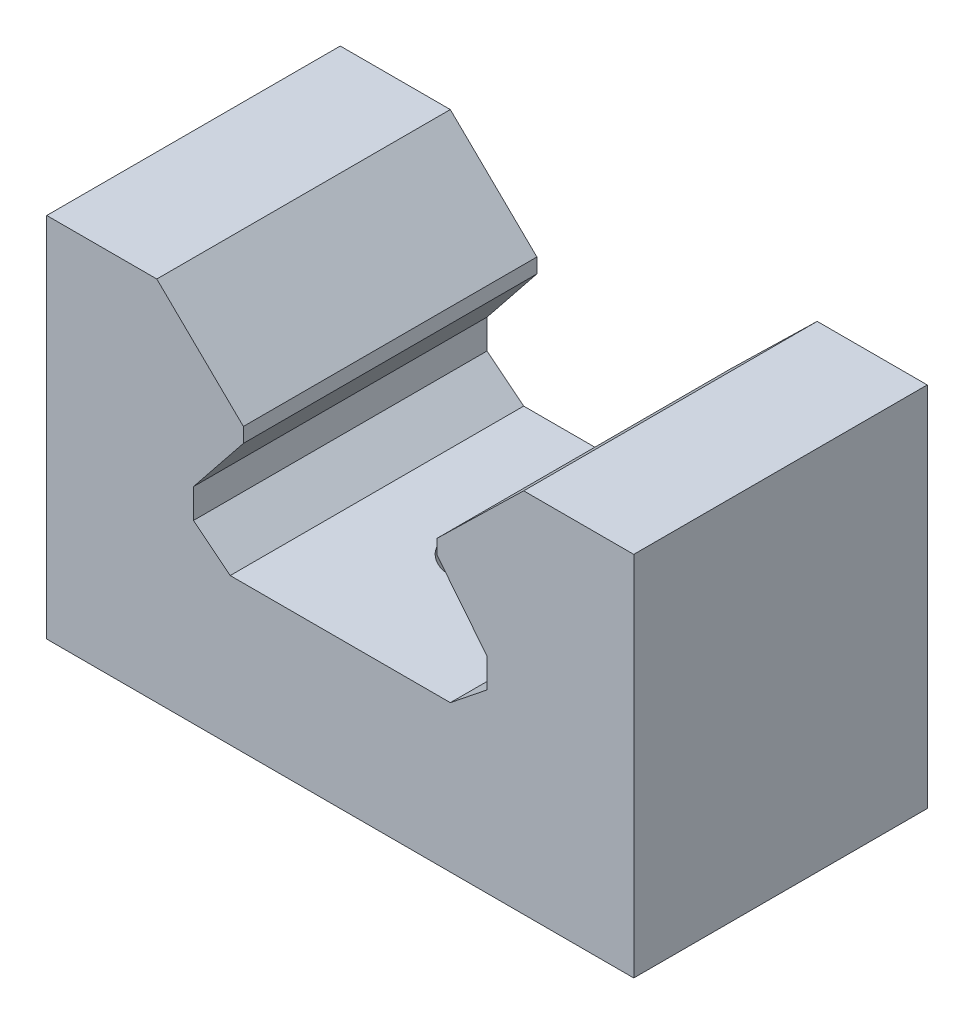
ISO-10303-21;
HEADER;
FILE_DESCRIPTION(('STEP AP214'),'2;1');
FILE_NAME('part.step','',(''),(''),'','','');
FILE_SCHEMA(('AUTOMOTIVE_DESIGN { 1 0 10303 214 1 1 1 1 }'));
ENDSEC;
DATA;
#1=APPLICATION_CONTEXT('core data for automotive mechanical design processes');
#2=APPLICATION_PROTOCOL_DEFINITION('international standard','automotive_design',2000,#1);
#3=PRODUCT_CONTEXT('',#1,'mechanical');
#4=PRODUCT('Part','Part','',(#3));
#5=PRODUCT_RELATED_PRODUCT_CATEGORY('part','',(#4));
#6=PRODUCT_DEFINITION_FORMATION('','',#4);
#7=PRODUCT_DEFINITION_CONTEXT('part definition',#1,'design');
#8=PRODUCT_DEFINITION('design','',#6,#7);
#9=PRODUCT_DEFINITION_SHAPE('','',#8);
#10=(LENGTH_UNIT() NAMED_UNIT(*) SI_UNIT(.MILLI.,.METRE.));
#11=(NAMED_UNIT(*) PLANE_ANGLE_UNIT() SI_UNIT($,.RADIAN.));
#12=(NAMED_UNIT(*) SI_UNIT($,.STERADIAN.) SOLID_ANGLE_UNIT());
#13=UNCERTAINTY_MEASURE_WITH_UNIT(LENGTH_MEASURE(1.E-05),#10,'distance_accuracy_value','');
#14=(GEOMETRIC_REPRESENTATION_CONTEXT(3) GLOBAL_UNCERTAINTY_ASSIGNED_CONTEXT((#13)) GLOBAL_UNIT_ASSIGNED_CONTEXT((#10,
#11,#12)) REPRESENTATION_CONTEXT('',''));
#15=CARTESIAN_POINT('',(0.,0.,0.));
#16=DIRECTION('',(0.,0.,1.));
#17=DIRECTION('',(1.,0.,0.));
#18=AXIS2_PLACEMENT_3D('',#15,#16,#17);
#19=CARTESIAN_POINT('',(-20.,12.5,20.));
#20=DIRECTION('',(0.,-1.,0.));
#21=DIRECTION('',(0.,0.,-1.));
#22=AXIS2_PLACEMENT_3D('',#19,#20,#21);
#23=PLANE('',#22);
#24=DIRECTION('',(0.,0.,1.));
#25=VECTOR('',#24,1.);
#26=CARTESIAN_POINT('',(-12.5,12.5,-64.0434422872475));
#27=LINE('',#26,#25);
#28=CARTESIAN_POINT('',(-12.5,12.5,0.));
#29=VERTEX_POINT('',#28);
#30=CARTESIAN_POINT('',(-12.5,12.5,20.));
#31=VERTEX_POINT('',#30);
#32=EDGE_CURVE('E178',#29,#31,#27,.T.);
#33=ORIENTED_EDGE('',*,*,#32,.F.);
#34=DIRECTION('',(-1.,0.,0.));
#35=VECTOR('',#34,1.);
#36=CARTESIAN_POINT('',(-20.,12.5,0.));
#37=LINE('',#36,#35);
#38=CARTESIAN_POINT('',(-20.,12.5,0.));
#39=VERTEX_POINT('',#38);
#40=EDGE_CURVE('E160',#29,#39,#37,.T.);
#41=ORIENTED_EDGE('',*,*,#40,.T.);
#42=DIRECTION('',(0.,0.,-1.));
#43=VECTOR('',#42,1.);
#44=CARTESIAN_POINT('',(-20.,12.5,20.));
#45=LINE('',#44,#43);
#46=CARTESIAN_POINT('',(-20.,12.5,20.));
#47=VERTEX_POINT('',#46);
#48=EDGE_CURVE('E50',#47,#39,#45,.T.);
#49=ORIENTED_EDGE('',*,*,#48,.F.);
#50=DIRECTION('',(-1.,0.,0.));
#51=VECTOR('',#50,1.);
#52=CARTESIAN_POINT('',(-20.,12.5,20.));
#53=LINE('',#52,#51);
#54=EDGE_CURVE('E213',#31,#47,#53,.T.);
#55=ORIENTED_EDGE('',*,*,#54,.F.);
#56=EDGE_LOOP('',(#33,#41,#49,#55));
#57=FACE_BOUND('',#56,.T.);
#58=ADVANCED_FACE('F42',(#57),#23,.F.);
#59=CARTESIAN_POINT('',(20.,12.5,20.));
#60=DIRECTION('',(-1.,0.,0.));
#61=DIRECTION('',(0.,0.,1.));
#62=AXIS2_PLACEMENT_3D('',#59,#60,#61);
#63=PLANE('',#62);
#64=DIRECTION('',(0.,1.,0.));
#65=VECTOR('',#64,1.);
#66=CARTESIAN_POINT('',(20.,12.5,0.));
#67=LINE('',#66,#65);
#68=CARTESIAN_POINT('',(20.,-12.5,0.));
#69=VERTEX_POINT('',#68);
#70=CARTESIAN_POINT('',(20.,12.5,0.));
#71=VERTEX_POINT('',#70);
#72=EDGE_CURVE('E209',#69,#71,#67,.T.);
#73=ORIENTED_EDGE('',*,*,#72,.T.);
#74=DIRECTION('',(0.,0.,-1.));
#75=VECTOR('',#74,1.);
#76=CARTESIAN_POINT('',(20.,12.5,20.));
#77=LINE('',#76,#75);
#78=CARTESIAN_POINT('',(20.,12.5,20.));
#79=VERTEX_POINT('',#78);
#80=EDGE_CURVE('E11',#79,#71,#77,.T.);
#81=ORIENTED_EDGE('',*,*,#80,.F.);
#82=DIRECTION('',(0.,1.,0.));
#83=VECTOR('',#82,1.);
#84=CARTESIAN_POINT('',(20.,12.5,20.));
#85=LINE('',#84,#83);
#86=CARTESIAN_POINT('',(20.,-12.5,20.));
#87=VERTEX_POINT('',#86);
#88=EDGE_CURVE('E210',#87,#79,#85,.T.);
#89=ORIENTED_EDGE('',*,*,#88,.F.);
#90=DIRECTION('',(0.,0.,-1.));
#91=VECTOR('',#90,1.);
#92=CARTESIAN_POINT('',(20.,-12.5,20.));
#93=LINE('',#92,#91);
#94=EDGE_CURVE('E221',#87,#69,#93,.T.);
#95=ORIENTED_EDGE('',*,*,#94,.T.);
#96=EDGE_LOOP('',(#73,#81,#89,#95));
#97=FACE_BOUND('',#96,.T.);
#98=ADVANCED_FACE('F44',(#97),#63,.F.);
#99=CARTESIAN_POINT('',(12.5,12.5,0.));
#100=VERTEX_POINT('',#99);
#101=EDGE_CURVE('E224',#71,#100,#37,.T.);
#102=ORIENTED_EDGE('',*,*,#101,.T.);
#103=DIRECTION('',(0.,0.,1.));
#104=VECTOR('',#103,1.);
#105=CARTESIAN_POINT('',(12.5,12.5,-64.0434422872475));
#106=LINE('',#105,#104);
#107=CARTESIAN_POINT('',(12.5,12.5,20.));
#108=VERTEX_POINT('',#107);
#109=EDGE_CURVE('E207',#100,#108,#106,.T.);
#110=ORIENTED_EDGE('',*,*,#109,.T.);
#111=EDGE_CURVE('E215',#79,#108,#53,.T.);
#112=ORIENTED_EDGE('',*,*,#111,.F.);
#113=ORIENTED_EDGE('',*,*,#80,.T.);
#114=EDGE_LOOP('',(#102,#110,#112,#113));
#115=FACE_BOUND('',#114,.T.);
#116=ADVANCED_FACE('F253',(#115),#23,.F.);
#117=CARTESIAN_POINT('',(-20.,12.5,20.));
#118=DIRECTION('',(1.,0.,0.));
#119=DIRECTION('',(0.,0.,-1.));
#120=AXIS2_PLACEMENT_3D('',#117,#118,#119);
#121=PLANE('',#120);
#122=DIRECTION('',(0.,-1.,0.));
#123=VECTOR('',#122,1.);
#124=CARTESIAN_POINT('',(-20.,12.5,0.));
#125=LINE('',#124,#123);
#126=CARTESIAN_POINT('',(-20.,-12.5,0.));
#127=VERTEX_POINT('',#126);
#128=EDGE_CURVE('E227',#39,#127,#125,.T.);
#129=ORIENTED_EDGE('',*,*,#128,.T.);
#130=DIRECTION('',(0.,0.,-1.));
#131=VECTOR('',#130,1.);
#132=CARTESIAN_POINT('',(-20.,-12.5,20.));
#133=LINE('',#132,#131);
#134=CARTESIAN_POINT('',(-20.,-12.5,20.));
#135=VERTEX_POINT('',#134);
#136=EDGE_CURVE('E232',#135,#127,#133,.T.);
#137=ORIENTED_EDGE('',*,*,#136,.F.);
#138=DIRECTION('',(0.,-1.,0.));
#139=VECTOR('',#138,1.);
#140=CARTESIAN_POINT('',(-20.,12.5,20.));
#141=LINE('',#140,#139);
#142=EDGE_CURVE('E217',#47,#135,#141,.T.);
#143=ORIENTED_EDGE('',*,*,#142,.F.);
#144=ORIENTED_EDGE('',*,*,#48,.T.);
#145=EDGE_LOOP('',(#129,#137,#143,#144));
#146=FACE_BOUND('',#145,.T.);
#147=ADVANCED_FACE('F238',(#146),#121,.F.);
#148=CARTESIAN_POINT('',(-20.,-12.5,20.));
#149=DIRECTION('',(0.,1.,0.));
#150=DIRECTION('',(0.,0.,1.));
#151=AXIS2_PLACEMENT_3D('',#148,#149,#150);
#152=PLANE('',#151);
#153=CARTESIAN_POINT('',(0.,-12.5,10.));
#154=DIRECTION('',(0.,-1.,0.));
#155=DIRECTION('',(0.,0.,-1.));
#156=AXIS2_PLACEMENT_3D('',#153,#154,#155);
#157=CIRCLE('',#156,2.5);
#158=CARTESIAN_POINT('',(0.,-12.5,7.5));
#159=VERTEX_POINT('',#158);
#160=EDGE_CURVE('E363',#159,#159,#157,.T.);
#161=ORIENTED_EDGE('',*,*,#160,.F.);
#162=EDGE_LOOP('',(#161));
#163=FACE_BOUND('',#162,.T.);
#164=DIRECTION('',(1.,0.,0.));
#165=VECTOR('',#164,1.);
#166=CARTESIAN_POINT('',(-20.,-12.5,0.));
#167=LINE('',#166,#165);
#168=EDGE_CURVE('E214',#127,#69,#167,.T.);
#169=ORIENTED_EDGE('',*,*,#168,.T.);
#170=ORIENTED_EDGE('',*,*,#94,.F.);
#171=DIRECTION('',(1.,0.,0.));
#172=VECTOR('',#171,1.);
#173=CARTESIAN_POINT('',(-20.,-12.5,20.));
#174=LINE('',#173,#172);
#175=EDGE_CURVE('E219',#135,#87,#174,.T.);
#176=ORIENTED_EDGE('',*,*,#175,.F.);
#177=ORIENTED_EDGE('',*,*,#136,.T.);
#178=EDGE_LOOP('',(#169,#170,#176,#177));
#179=FACE_BOUND('',#178,.T.);
#180=ADVANCED_FACE('F246',(#163,#179),#152,.F.);
#181=CARTESIAN_POINT('',(0.,0.,20.));
#182=DIRECTION('',(0.,0.,1.));
#183=DIRECTION('',(1.,0.,0.));
#184=AXIS2_PLACEMENT_3D('',#181,#182,#183);
#185=PLANE('',#184);
#186=DIRECTION('',(0.716151801181329,0.697944551998752,0.));
#187=VECTOR('',#186,1.);
#188=CARTESIAN_POINT('',(6.6,6.75000000000001,20.));
#189=LINE('',#188,#187);
#190=CARTESIAN_POINT('',(6.6,6.75000000000001,20.));
#191=VERTEX_POINT('',#190);
#192=EDGE_CURVE('E57',#191,#108,#189,.T.);
#193=ORIENTED_EDGE('',*,*,#192,.F.);
#194=DIRECTION('',(0.,1.,0.));
#195=VECTOR('',#194,1.);
#196=CARTESIAN_POINT('',(6.6,5.75000000000001,20.));
#197=LINE('',#196,#195);
#198=CARTESIAN_POINT('',(6.6,5.75000000000001,20.));
#199=VERTEX_POINT('',#198);
#200=EDGE_CURVE('E61',#199,#191,#197,.T.);
#201=ORIENTED_EDGE('',*,*,#200,.F.);
#202=DIRECTION('',(-0.624695047554424,0.780868809443031,0.));
#203=VECTOR('',#202,1.);
#204=CARTESIAN_POINT('',(10.,1.5,20.));
#205=LINE('',#204,#203);
#206=CARTESIAN_POINT('',(10.,1.5,20.));
#207=VERTEX_POINT('',#206);
#208=EDGE_CURVE('E270',#207,#199,#205,.T.);
#209=ORIENTED_EDGE('',*,*,#208,.F.);
#210=DIRECTION('',(0.,1.,0.));
#211=VECTOR('',#210,1.);
#212=CARTESIAN_POINT('',(10.,-0.499999999999995,20.));
#213=LINE('',#212,#211);
#214=CARTESIAN_POINT('',(10.,-0.499999999999996,20.));
#215=VERTEX_POINT('',#214);
#216=EDGE_CURVE('E294',#215,#207,#213,.T.);
#217=ORIENTED_EDGE('',*,*,#216,.F.);
#218=DIRECTION('',(0.78086880944303,0.624695047554424,0.));
#219=VECTOR('',#218,1.);
#220=CARTESIAN_POINT('',(7.5,-2.5,20.));
#221=LINE('',#220,#219);
#222=CARTESIAN_POINT('',(7.5,-2.5,20.));
#223=VERTEX_POINT('',#222);
#224=EDGE_CURVE('E291',#223,#215,#221,.T.);
#225=ORIENTED_EDGE('',*,*,#224,.F.);
#226=DIRECTION('',(1.,0.,0.));
#227=VECTOR('',#226,1.);
#228=CARTESIAN_POINT('',(7.5,-2.5,20.));
#229=LINE('',#228,#227);
#230=CARTESIAN_POINT('',(-7.5,-2.49999999999999,20.));
#231=VERTEX_POINT('',#230);
#232=EDGE_CURVE('E288',#231,#223,#229,.T.);
#233=ORIENTED_EDGE('',*,*,#232,.F.);
#234=DIRECTION('',(0.780868809443031,-0.624695047554424,0.));
#235=VECTOR('',#234,1.);
#236=CARTESIAN_POINT('',(-7.5,-2.49999999999999,20.));
#237=LINE('',#236,#235);
#238=CARTESIAN_POINT('',(-10.,-0.499999999999995,20.));
#239=VERTEX_POINT('',#238);
#240=EDGE_CURVE('E285',#239,#231,#237,.T.);
#241=ORIENTED_EDGE('',*,*,#240,.F.);
#242=DIRECTION('',(0.,-1.,0.));
#243=VECTOR('',#242,1.);
#244=CARTESIAN_POINT('',(-10.,-0.499999999999995,20.));
#245=LINE('',#244,#243);
#246=CARTESIAN_POINT('',(-10.,1.5,20.));
#247=VERTEX_POINT('',#246);
#248=EDGE_CURVE('E282',#247,#239,#245,.T.);
#249=ORIENTED_EDGE('',*,*,#248,.F.);
#250=DIRECTION('',(-0.624695047554424,-0.780868809443031,0.));
#251=VECTOR('',#250,1.);
#252=CARTESIAN_POINT('',(-10.,1.5,20.));
#253=LINE('',#252,#251);
#254=CARTESIAN_POINT('',(-6.6,5.75000000000001,20.));
#255=VERTEX_POINT('',#254);
#256=EDGE_CURVE('E279',#255,#247,#253,.T.);
#257=ORIENTED_EDGE('',*,*,#256,.F.);
#258=DIRECTION('',(0.,-1.,0.));
#259=VECTOR('',#258,1.);
#260=CARTESIAN_POINT('',(-6.6,5.75000000000001,20.));
#261=LINE('',#260,#259);
#262=CARTESIAN_POINT('',(-6.6,6.75000000000001,20.));
#263=VERTEX_POINT('',#262);
#264=EDGE_CURVE('E277',#263,#255,#261,.T.);
#265=ORIENTED_EDGE('',*,*,#264,.F.);
#266=DIRECTION('',(0.716151801181329,-0.697944551998752,0.));
#267=VECTOR('',#266,1.);
#268=CARTESIAN_POINT('',(-6.6,6.75000000000001,20.));
#269=LINE('',#268,#267);
#270=EDGE_CURVE('E164',#31,#263,#269,.T.);
#271=ORIENTED_EDGE('',*,*,#270,.F.);
#272=ORIENTED_EDGE('',*,*,#54,.T.);
#273=ORIENTED_EDGE('',*,*,#142,.T.);
#274=ORIENTED_EDGE('',*,*,#175,.T.);
#275=ORIENTED_EDGE('',*,*,#88,.T.);
#276=ORIENTED_EDGE('',*,*,#111,.T.);
#277=EDGE_LOOP('',(#193,#201,#209,#217,#225,#233,#241,#249,#257,#265,#271,#272,#273,#274,#275,#276));
#278=FACE_BOUND('',#277,.T.);
#279=ADVANCED_FACE('F251',(#278),#185,.T.);
#280=CARTESIAN_POINT('',(0.,0.,0.));
#281=DIRECTION('',(0.,0.,1.));
#282=DIRECTION('',(1.,0.,0.));
#283=AXIS2_PLACEMENT_3D('',#280,#281,#282);
#284=PLANE('',#283);
#285=DIRECTION('',(0.,1.,0.));
#286=VECTOR('',#285,1.);
#287=CARTESIAN_POINT('',(6.6,5.75000000000001,0.));
#288=LINE('',#287,#286);
#289=CARTESIAN_POINT('',(6.6,5.75000000000001,0.));
#290=VERTEX_POINT('',#289);
#291=CARTESIAN_POINT('',(6.6,6.75000000000001,0.));
#292=VERTEX_POINT('',#291);
#293=EDGE_CURVE('E299',#290,#292,#288,.T.);
#294=ORIENTED_EDGE('',*,*,#293,.T.);
#295=DIRECTION('',(0.716151801181329,0.697944551998752,0.));
#296=VECTOR('',#295,1.);
#297=CARTESIAN_POINT('',(6.6,6.75000000000001,0.));
#298=LINE('',#297,#296);
#299=EDGE_CURVE('E267',#292,#100,#298,.T.);
#300=ORIENTED_EDGE('',*,*,#299,.T.);
#301=ORIENTED_EDGE('',*,*,#101,.F.);
#302=ORIENTED_EDGE('',*,*,#72,.F.);
#303=ORIENTED_EDGE('',*,*,#168,.F.);
#304=ORIENTED_EDGE('',*,*,#128,.F.);
#305=ORIENTED_EDGE('',*,*,#40,.F.);
#306=DIRECTION('',(0.716151801181329,-0.697944551998752,0.));
#307=VECTOR('',#306,1.);
#308=CARTESIAN_POINT('',(-6.6,6.75000000000001,0.));
#309=LINE('',#308,#307);
#310=CARTESIAN_POINT('',(-6.6,6.75000000000001,0.));
#311=VERTEX_POINT('',#310);
#312=EDGE_CURVE('E154',#29,#311,#309,.T.);
#313=ORIENTED_EDGE('',*,*,#312,.T.);
#314=DIRECTION('',(0.,-1.,0.));
#315=VECTOR('',#314,1.);
#316=CARTESIAN_POINT('',(-6.6,5.75000000000001,0.));
#317=LINE('',#316,#315);
#318=CARTESIAN_POINT('',(-6.6,5.75000000000001,0.));
#319=VERTEX_POINT('',#318);
#320=EDGE_CURVE('E157',#311,#319,#317,.T.);
#321=ORIENTED_EDGE('',*,*,#320,.T.);
#322=DIRECTION('',(-0.624695047554424,-0.780868809443031,0.));
#323=VECTOR('',#322,1.);
#324=CARTESIAN_POINT('',(-10.,1.5,0.));
#325=LINE('',#324,#323);
#326=CARTESIAN_POINT('',(-10.,1.5,0.));
#327=VERTEX_POINT('',#326);
#328=EDGE_CURVE('E174',#319,#327,#325,.T.);
#329=ORIENTED_EDGE('',*,*,#328,.T.);
#330=DIRECTION('',(0.,-1.,0.));
#331=VECTOR('',#330,1.);
#332=CARTESIAN_POINT('',(-10.,-0.499999999999995,0.));
#333=LINE('',#332,#331);
#334=CARTESIAN_POINT('',(-10.,-0.499999999999995,0.));
#335=VERTEX_POINT('',#334);
#336=EDGE_CURVE('E311',#327,#335,#333,.T.);
#337=ORIENTED_EDGE('',*,*,#336,.T.);
#338=DIRECTION('',(0.780868809443031,-0.624695047554424,0.));
#339=VECTOR('',#338,1.);
#340=CARTESIAN_POINT('',(-7.5,-2.49999999999999,0.));
#341=LINE('',#340,#339);
#342=CARTESIAN_POINT('',(-7.5,-2.49999999999999,0.));
#343=VERTEX_POINT('',#342);
#344=EDGE_CURVE('E309',#335,#343,#341,.T.);
#345=ORIENTED_EDGE('',*,*,#344,.T.);
#346=DIRECTION('',(1.,0.,0.));
#347=VECTOR('',#346,1.);
#348=CARTESIAN_POINT('',(7.5,-2.5,0.));
#349=LINE('',#348,#347);
#350=CARTESIAN_POINT('',(7.5,-2.5,0.));
#351=VERTEX_POINT('',#350);
#352=EDGE_CURVE('E307',#343,#351,#349,.T.);
#353=ORIENTED_EDGE('',*,*,#352,.T.);
#354=DIRECTION('',(0.78086880944303,0.624695047554424,0.));
#355=VECTOR('',#354,1.);
#356=CARTESIAN_POINT('',(7.5,-2.5,0.));
#357=LINE('',#356,#355);
#358=CARTESIAN_POINT('',(10.,-0.499999999999996,0.));
#359=VERTEX_POINT('',#358);
#360=EDGE_CURVE('E305',#351,#359,#357,.T.);
#361=ORIENTED_EDGE('',*,*,#360,.T.);
#362=DIRECTION('',(0.,1.,0.));
#363=VECTOR('',#362,1.);
#364=CARTESIAN_POINT('',(10.,-0.499999999999995,0.));
#365=LINE('',#364,#363);
#366=CARTESIAN_POINT('',(10.,1.5,0.));
#367=VERTEX_POINT('',#366);
#368=EDGE_CURVE('E303',#359,#367,#365,.T.);
#369=ORIENTED_EDGE('',*,*,#368,.T.);
#370=DIRECTION('',(-0.624695047554424,0.780868809443031,0.));
#371=VECTOR('',#370,1.);
#372=CARTESIAN_POINT('',(10.,1.5,0.));
#373=LINE('',#372,#371);
#374=EDGE_CURVE('E301',#367,#290,#373,.T.);
#375=ORIENTED_EDGE('',*,*,#374,.T.);
#376=EDGE_LOOP('',(#294,#300,#301,#302,#303,#304,#305,#313,#321,#329,#337,#345,#353,#361,#369,#375));
#377=FACE_BOUND('',#376,.T.);
#378=ADVANCED_FACE('F156',(#377),#284,.F.);
#379=CARTESIAN_POINT('',(6.6,6.75000000000001,-64.0434422872475));
#380=DIRECTION('',(-0.697944551998752,0.716151801181329,0.));
#381=DIRECTION('',(-0.716151801181329,-0.697944551998752,0.));
#382=AXIS2_PLACEMENT_3D('',#379,#380,#381);
#383=PLANE('',#382);
#384=ORIENTED_EDGE('',*,*,#299,.F.);
#385=DIRECTION('',(0.,0.,1.));
#386=VECTOR('',#385,1.);
#387=CARTESIAN_POINT('',(6.6,6.75000000000001,-64.0434422872475));
#388=LINE('',#387,#386);
#389=EDGE_CURVE('E204',#292,#191,#388,.T.);
#390=ORIENTED_EDGE('',*,*,#389,.T.);
#391=ORIENTED_EDGE('',*,*,#192,.T.);
#392=ORIENTED_EDGE('',*,*,#109,.F.);
#393=EDGE_LOOP('',(#384,#390,#391,#392));
#394=FACE_BOUND('',#393,.T.);
#395=ADVANCED_FACE('F266',(#394),#383,.T.);
#396=CARTESIAN_POINT('',(6.6,5.75000000000001,-64.0434422872475));
#397=DIRECTION('',(-1.,0.,0.));
#398=DIRECTION('',(0.,0.,1.));
#399=AXIS2_PLACEMENT_3D('',#396,#397,#398);
#400=PLANE('',#399);
#401=ORIENTED_EDGE('',*,*,#293,.F.);
#402=DIRECTION('',(0.,0.,1.));
#403=VECTOR('',#402,1.);
#404=CARTESIAN_POINT('',(6.6,5.75000000000001,-64.0434422872475));
#405=LINE('',#404,#403);
#406=EDGE_CURVE('E201',#290,#199,#405,.T.);
#407=ORIENTED_EDGE('',*,*,#406,.T.);
#408=ORIENTED_EDGE('',*,*,#200,.T.);
#409=ORIENTED_EDGE('',*,*,#389,.F.);
#410=EDGE_LOOP('',(#401,#407,#408,#409));
#411=FACE_BOUND('',#410,.T.);
#412=ADVANCED_FACE('F342',(#411),#400,.T.);
#413=CARTESIAN_POINT('',(10.,1.5,-64.0434422872475));
#414=DIRECTION('',(-0.780868809443031,-0.624695047554424,0.));
#415=DIRECTION('',(0.624695047554424,-0.780868809443031,0.));
#416=AXIS2_PLACEMENT_3D('',#413,#414,#415);
#417=PLANE('',#416);
#418=ORIENTED_EDGE('',*,*,#374,.F.);
#419=DIRECTION('',(0.,0.,1.));
#420=VECTOR('',#419,1.);
#421=CARTESIAN_POINT('',(10.,1.5,-64.0434422872475));
#422=LINE('',#421,#420);
#423=EDGE_CURVE('E198',#367,#207,#422,.T.);
#424=ORIENTED_EDGE('',*,*,#423,.T.);
#425=ORIENTED_EDGE('',*,*,#208,.T.);
#426=ORIENTED_EDGE('',*,*,#406,.F.);
#427=EDGE_LOOP('',(#418,#424,#425,#426));
#428=FACE_BOUND('',#427,.T.);
#429=ADVANCED_FACE('F338',(#428),#417,.T.);
#430=CARTESIAN_POINT('',(10.,-0.499999999999995,-64.0434422872475));
#431=DIRECTION('',(-1.,0.,0.));
#432=DIRECTION('',(0.,0.,1.));
#433=AXIS2_PLACEMENT_3D('',#430,#431,#432);
#434=PLANE('',#433);
#435=ORIENTED_EDGE('',*,*,#368,.F.);
#436=DIRECTION('',(0.,0.,1.));
#437=VECTOR('',#436,1.);
#438=CARTESIAN_POINT('',(10.,-0.499999999999995,-64.0434422872475));
#439=LINE('',#438,#437);
#440=EDGE_CURVE('E195',#359,#215,#439,.T.);
#441=ORIENTED_EDGE('',*,*,#440,.T.);
#442=ORIENTED_EDGE('',*,*,#216,.T.);
#443=ORIENTED_EDGE('',*,*,#423,.F.);
#444=EDGE_LOOP('',(#435,#441,#442,#443));
#445=FACE_BOUND('',#444,.T.);
#446=ADVANCED_FACE('F336',(#445),#434,.T.);
#447=CARTESIAN_POINT('',(7.5,-2.5,-64.0434422872475));
#448=DIRECTION('',(-0.624695047554424,0.78086880944303,0.));
#449=DIRECTION('',(-0.78086880944303,-0.624695047554424,0.));
#450=AXIS2_PLACEMENT_3D('',#447,#448,#449);
#451=PLANE('',#450);
#452=ORIENTED_EDGE('',*,*,#360,.F.);
#453=DIRECTION('',(0.,0.,1.));
#454=VECTOR('',#453,1.);
#455=CARTESIAN_POINT('',(7.5,-2.5,-64.0434422872475));
#456=LINE('',#455,#454);
#457=EDGE_CURVE('E192',#351,#223,#456,.T.);
#458=ORIENTED_EDGE('',*,*,#457,.T.);
#459=ORIENTED_EDGE('',*,*,#224,.T.);
#460=ORIENTED_EDGE('',*,*,#440,.F.);
#461=EDGE_LOOP('',(#452,#458,#459,#460));
#462=FACE_BOUND('',#461,.T.);
#463=ADVANCED_FACE('F330',(#462),#451,.T.);
#464=CARTESIAN_POINT('',(7.5,-2.5,-64.0434422872475));
#465=DIRECTION('',(0.,1.,0.));
#466=DIRECTION('',(-1.,0.,0.));
#467=AXIS2_PLACEMENT_3D('',#464,#465,#466);
#468=PLANE('',#467);
#469=CARTESIAN_POINT('',(0.,-2.5,10.));
#470=DIRECTION('',(0.,1.,0.));
#471=DIRECTION('',(-1.,0.,0.));
#472=AXIS2_PLACEMENT_3D('',#469,#470,#471);
#473=CIRCLE('',#472,2.5);
#474=CARTESIAN_POINT('',(-2.5,-2.49999999999999,10.));
#475=VERTEX_POINT('',#474);
#476=EDGE_CURVE('E274',#475,#475,#473,.T.);
#477=ORIENTED_EDGE('',*,*,#476,.F.);
#478=EDGE_LOOP('',(#477));
#479=FACE_BOUND('',#478,.T.);
#480=ORIENTED_EDGE('',*,*,#352,.F.);
#481=DIRECTION('',(0.,0.,1.));
#482=VECTOR('',#481,1.);
#483=CARTESIAN_POINT('',(-7.5,-2.49999999999999,-64.0434422872475));
#484=LINE('',#483,#482);
#485=EDGE_CURVE('E189',#343,#231,#484,.T.);
#486=ORIENTED_EDGE('',*,*,#485,.T.);
#487=ORIENTED_EDGE('',*,*,#232,.T.);
#488=ORIENTED_EDGE('',*,*,#457,.F.);
#489=EDGE_LOOP('',(#480,#486,#487,#488));
#490=FACE_BOUND('',#489,.T.);
#491=ADVANCED_FACE('F328',(#479,#490),#468,.T.);
#492=CARTESIAN_POINT('',(-7.5,-2.49999999999999,-64.0434422872475));
#493=DIRECTION('',(0.624695047554424,0.780868809443031,0.));
#494=DIRECTION('',(-0.780868809443031,0.624695047554424,0.));
#495=AXIS2_PLACEMENT_3D('',#492,#493,#494);
#496=PLANE('',#495);
#497=ORIENTED_EDGE('',*,*,#344,.F.);
#498=DIRECTION('',(0.,0.,1.));
#499=VECTOR('',#498,1.);
#500=CARTESIAN_POINT('',(-10.,-0.499999999999995,-64.0434422872475));
#501=LINE('',#500,#499);
#502=EDGE_CURVE('E186',#335,#239,#501,.T.);
#503=ORIENTED_EDGE('',*,*,#502,.T.);
#504=ORIENTED_EDGE('',*,*,#240,.T.);
#505=ORIENTED_EDGE('',*,*,#485,.F.);
#506=EDGE_LOOP('',(#497,#503,#504,#505));
#507=FACE_BOUND('',#506,.T.);
#508=ADVANCED_FACE('F322',(#507),#496,.T.);
#509=CARTESIAN_POINT('',(-10.,-0.499999999999995,-64.0434422872475));
#510=DIRECTION('',(1.,0.,0.));
#511=DIRECTION('',(0.,0.,-1.));
#512=AXIS2_PLACEMENT_3D('',#509,#510,#511);
#513=PLANE('',#512);
#514=ORIENTED_EDGE('',*,*,#336,.F.);
#515=DIRECTION('',(0.,0.,1.));
#516=VECTOR('',#515,1.);
#517=CARTESIAN_POINT('',(-10.,1.5,-64.0434422872475));
#518=LINE('',#517,#516);
#519=EDGE_CURVE('E180',#327,#247,#518,.T.);
#520=ORIENTED_EDGE('',*,*,#519,.T.);
#521=ORIENTED_EDGE('',*,*,#248,.T.);
#522=ORIENTED_EDGE('',*,*,#502,.F.);
#523=EDGE_LOOP('',(#514,#520,#521,#522));
#524=FACE_BOUND('',#523,.T.);
#525=ADVANCED_FACE('F319',(#524),#513,.T.);
#526=CARTESIAN_POINT('',(-10.,1.5,-64.0434422872475));
#527=DIRECTION('',(0.780868809443031,-0.624695047554424,0.));
#528=DIRECTION('',(0.624695047554424,0.780868809443031,0.));
#529=AXIS2_PLACEMENT_3D('',#526,#527,#528);
#530=PLANE('',#529);
#531=ORIENTED_EDGE('',*,*,#328,.F.);
#532=DIRECTION('',(0.,0.,1.));
#533=VECTOR('',#532,1.);
#534=CARTESIAN_POINT('',(-6.6,5.75000000000001,-64.0434422872475));
#535=LINE('',#534,#533);
#536=EDGE_CURVE('E173',#319,#255,#535,.T.);
#537=ORIENTED_EDGE('',*,*,#536,.T.);
#538=ORIENTED_EDGE('',*,*,#256,.T.);
#539=ORIENTED_EDGE('',*,*,#519,.F.);
#540=EDGE_LOOP('',(#531,#537,#538,#539));
#541=FACE_BOUND('',#540,.T.);
#542=ADVANCED_FACE('F320',(#541),#530,.T.);
#543=CARTESIAN_POINT('',(-6.6,5.75000000000001,-64.0434422872475));
#544=DIRECTION('',(1.,0.,0.));
#545=DIRECTION('',(0.,0.,-1.));
#546=AXIS2_PLACEMENT_3D('',#543,#544,#545);
#547=PLANE('',#546);
#548=ORIENTED_EDGE('',*,*,#320,.F.);
#549=DIRECTION('',(0.,0.,1.));
#550=VECTOR('',#549,1.);
#551=CARTESIAN_POINT('',(-6.6,6.75000000000001,-64.0434422872475));
#552=LINE('',#551,#550);
#553=EDGE_CURVE('E171',#311,#263,#552,.T.);
#554=ORIENTED_EDGE('',*,*,#553,.T.);
#555=ORIENTED_EDGE('',*,*,#264,.T.);
#556=ORIENTED_EDGE('',*,*,#536,.F.);
#557=EDGE_LOOP('',(#548,#554,#555,#556));
#558=FACE_BOUND('',#557,.T.);
#559=ADVANCED_FACE('F169',(#558),#547,.T.);
#560=CARTESIAN_POINT('',(-6.6,6.75000000000001,-64.0434422872475));
#561=DIRECTION('',(0.697944551998752,0.716151801181329,0.));
#562=DIRECTION('',(-0.716151801181329,0.697944551998752,0.));
#563=AXIS2_PLACEMENT_3D('',#560,#561,#562);
#564=PLANE('',#563);
#565=ORIENTED_EDGE('',*,*,#312,.F.);
#566=ORIENTED_EDGE('',*,*,#32,.T.);
#567=ORIENTED_EDGE('',*,*,#270,.T.);
#568=ORIENTED_EDGE('',*,*,#553,.F.);
#569=EDGE_LOOP('',(#565,#566,#567,#568));
#570=FACE_BOUND('',#569,.T.);
#571=ADVANCED_FACE('F177',(#570),#564,.T.);
#572=CARTESIAN_POINT('',(0.,-12.5,10.));
#573=DIRECTION('',(0.,-1.,0.));
#574=DIRECTION('',(0.,0.,-1.));
#575=AXIS2_PLACEMENT_3D('',#572,#573,#574);
#576=CYLINDRICAL_SURFACE('',#575,2.5);
#577=ORIENTED_EDGE('',*,*,#476,.T.);
#578=EDGE_LOOP('',(#577));
#579=FACE_BOUND('',#578,.T.);
#580=ORIENTED_EDGE('',*,*,#160,.T.);
#581=EDGE_LOOP('',(#580));
#582=FACE_BOUND('',#581,.T.);
#583=ADVANCED_FACE('F368',(#579,#582),#576,.F.);
#584=CLOSED_SHELL('',(#58,#98,#116,#147,#180,#279,#378,#395,#412,#429,#446,#463,#491,#508,#525,
#542,#559,#571,#583));
#585=MANIFOLD_SOLID_BREP('B2',#584);
#586=ADVANCED_BREP_SHAPE_REPRESENTATION('',(#18,#585),#14);
#587=SHAPE_DEFINITION_REPRESENTATION(#9,#586);
ENDSEC;
END-ISO-10303-21;
